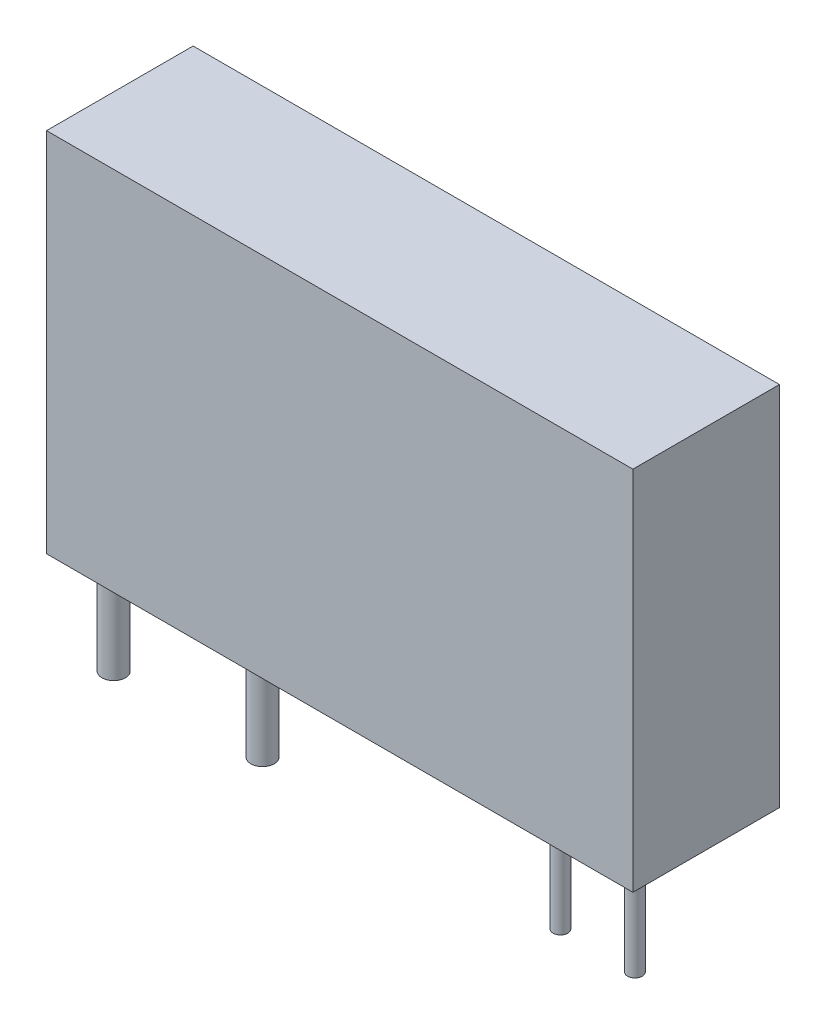
ISO-10303-21;
HEADER;
FILE_DESCRIPTION(('STEP AP214'),'2;1');
FILE_NAME('part.step','',(''),(''),'','','');
FILE_SCHEMA(('AUTOMOTIVE_DESIGN { 1 0 10303 214 1 1 1 1 }'));
ENDSEC;
DATA;
#1=APPLICATION_CONTEXT('core data for automotive mechanical design processes');
#2=APPLICATION_PROTOCOL_DEFINITION('international standard','automotive_design',2000,#1);
#3=PRODUCT_CONTEXT('',#1,'mechanical');
#4=PRODUCT('Part','Part','',(#3));
#5=PRODUCT_RELATED_PRODUCT_CATEGORY('part','',(#4));
#6=PRODUCT_DEFINITION_FORMATION('','',#4);
#7=PRODUCT_DEFINITION_CONTEXT('part definition',#1,'design');
#8=PRODUCT_DEFINITION('design','',#6,#7);
#9=PRODUCT_DEFINITION_SHAPE('','',#8);
#10=(LENGTH_UNIT() NAMED_UNIT(*) SI_UNIT(.MILLI.,.METRE.));
#11=(NAMED_UNIT(*) PLANE_ANGLE_UNIT() SI_UNIT($,.RADIAN.));
#12=(NAMED_UNIT(*) SI_UNIT($,.STERADIAN.) SOLID_ANGLE_UNIT());
#13=UNCERTAINTY_MEASURE_WITH_UNIT(LENGTH_MEASURE(1.E-05),#10,'distance_accuracy_value','');
#14=(GEOMETRIC_REPRESENTATION_CONTEXT(3) GLOBAL_UNCERTAINTY_ASSIGNED_CONTEXT((#13)) GLOBAL_UNIT_ASSIGNED_CONTEXT((#10,
#11,#12)) REPRESENTATION_CONTEXT('',''));
#15=CARTESIAN_POINT('',(0.,0.,0.));
#16=DIRECTION('',(0.,0.,1.));
#17=DIRECTION('',(1.,0.,0.));
#18=AXIS2_PLACEMENT_3D('',#15,#16,#17);
#19=CARTESIAN_POINT('',(-10.,12.5,2.50000000000001));
#20=DIRECTION('',(1.,0.,0.));
#21=DIRECTION('',(0.,0.,-1.));
#22=AXIS2_PLACEMENT_3D('',#19,#20,#21);
#23=PLANE('',#22);
#24=DIRECTION('',(0.,0.,1.));
#25=VECTOR('',#24,1.);
#26=CARTESIAN_POINT('',(-10.,0.,2.50000000000001));
#27=LINE('',#26,#25);
#28=CARTESIAN_POINT('',(-10.,0.,-2.5));
#29=VERTEX_POINT('',#28);
#30=CARTESIAN_POINT('',(-10.,0.,2.50000000000001));
#31=VERTEX_POINT('',#30);
#32=EDGE_CURVE('E102',#29,#31,#27,.T.);
#33=ORIENTED_EDGE('',*,*,#32,.T.);
#34=DIRECTION('',(0.,-1.,0.));
#35=VECTOR('',#34,1.);
#36=CARTESIAN_POINT('',(-10.,12.5,2.50000000000001));
#37=LINE('',#36,#35);
#38=CARTESIAN_POINT('',(-10.,12.5,2.50000000000001));
#39=VERTEX_POINT('',#38);
#40=EDGE_CURVE('E93',#39,#31,#37,.T.);
#41=ORIENTED_EDGE('',*,*,#40,.F.);
#42=DIRECTION('',(0.,0.,1.));
#43=VECTOR('',#42,1.);
#44=CARTESIAN_POINT('',(-10.,12.5,2.50000000000001));
#45=LINE('',#44,#43);
#46=CARTESIAN_POINT('',(-10.,12.5,-2.5));
#47=VERTEX_POINT('',#46);
#48=EDGE_CURVE('E87',#47,#39,#45,.T.);
#49=ORIENTED_EDGE('',*,*,#48,.F.);
#50=DIRECTION('',(0.,-1.,0.));
#51=VECTOR('',#50,1.);
#52=CARTESIAN_POINT('',(-10.,12.5,-2.5));
#53=LINE('',#52,#51);
#54=EDGE_CURVE('E98',#47,#29,#53,.T.);
#55=ORIENTED_EDGE('',*,*,#54,.T.);
#56=EDGE_LOOP('',(#33,#41,#49,#55));
#57=FACE_BOUND('',#56,.T.);
#58=ADVANCED_FACE('F35',(#57),#23,.F.);
#59=CARTESIAN_POINT('',(9.99999999999996,12.5,2.5));
#60=DIRECTION('',(0.,0.,-1.));
#61=DIRECTION('',(-1.,0.,0.));
#62=AXIS2_PLACEMENT_3D('',#59,#60,#61);
#63=PLANE('',#62);
#64=DIRECTION('',(1.,0.,0.));
#65=VECTOR('',#64,1.);
#66=CARTESIAN_POINT('',(9.99999999999996,0.,2.5));
#67=LINE('',#66,#65);
#68=CARTESIAN_POINT('',(9.99999999999996,0.,2.5));
#69=VERTEX_POINT('',#68);
#70=EDGE_CURVE('E92',#31,#69,#67,.T.);
#71=ORIENTED_EDGE('',*,*,#70,.T.);
#72=DIRECTION('',(0.,-1.,0.));
#73=VECTOR('',#72,1.);
#74=CARTESIAN_POINT('',(9.99999999999996,12.5,2.5));
#75=LINE('',#74,#73);
#76=CARTESIAN_POINT('',(9.99999999999996,12.5,2.5));
#77=VERTEX_POINT('',#76);
#78=EDGE_CURVE('E90',#77,#69,#75,.T.);
#79=ORIENTED_EDGE('',*,*,#78,.F.);
#80=DIRECTION('',(1.,0.,0.));
#81=VECTOR('',#80,1.);
#82=CARTESIAN_POINT('',(9.99999999999996,12.5,2.5));
#83=LINE('',#82,#81);
#84=EDGE_CURVE('E82',#39,#77,#83,.T.);
#85=ORIENTED_EDGE('',*,*,#84,.F.);
#86=ORIENTED_EDGE('',*,*,#40,.T.);
#87=EDGE_LOOP('',(#71,#79,#85,#86));
#88=FACE_BOUND('',#87,.T.);
#89=ADVANCED_FACE('F91',(#88),#63,.F.);
#90=CARTESIAN_POINT('',(9.99999999999996,12.5,2.5));
#91=DIRECTION('',(-1.,0.,0.));
#92=DIRECTION('',(0.,0.,1.));
#93=AXIS2_PLACEMENT_3D('',#90,#91,#92);
#94=PLANE('',#93);
#95=DIRECTION('',(0.,0.,-1.));
#96=VECTOR('',#95,1.);
#97=CARTESIAN_POINT('',(9.99999999999996,0.,2.5));
#98=LINE('',#97,#96);
#99=CARTESIAN_POINT('',(9.99999999999996,0.,-2.5));
#100=VERTEX_POINT('',#99);
#101=EDGE_CURVE('E68',#69,#100,#98,.T.);
#102=ORIENTED_EDGE('',*,*,#101,.T.);
#103=DIRECTION('',(0.,-1.,0.));
#104=VECTOR('',#103,1.);
#105=CARTESIAN_POINT('',(9.99999999999996,12.5,-2.5));
#106=LINE('',#105,#104);
#107=CARTESIAN_POINT('',(9.99999999999996,12.5,-2.5));
#108=VERTEX_POINT('',#107);
#109=EDGE_CURVE('E94',#108,#100,#106,.T.);
#110=ORIENTED_EDGE('',*,*,#109,.F.);
#111=DIRECTION('',(0.,0.,-1.));
#112=VECTOR('',#111,1.);
#113=CARTESIAN_POINT('',(9.99999999999996,12.5,2.5));
#114=LINE('',#113,#112);
#115=EDGE_CURVE('E85',#77,#108,#114,.T.);
#116=ORIENTED_EDGE('',*,*,#115,.F.);
#117=ORIENTED_EDGE('',*,*,#78,.T.);
#118=EDGE_LOOP('',(#102,#110,#116,#117));
#119=FACE_BOUND('',#118,.T.);
#120=ADVANCED_FACE('F96',(#119),#94,.F.);
#121=CARTESIAN_POINT('',(9.99999999999996,12.5,-2.5));
#122=DIRECTION('',(0.,0.,1.));
#123=DIRECTION('',(1.,0.,0.));
#124=AXIS2_PLACEMENT_3D('',#121,#122,#123);
#125=PLANE('',#124);
#126=DIRECTION('',(-1.,0.,0.));
#127=VECTOR('',#126,1.);
#128=CARTESIAN_POINT('',(9.99999999999996,0.,-2.5));
#129=LINE('',#128,#127);
#130=EDGE_CURVE('E74',#100,#29,#129,.T.);
#131=ORIENTED_EDGE('',*,*,#130,.T.);
#132=ORIENTED_EDGE('',*,*,#54,.F.);
#133=DIRECTION('',(-1.,0.,0.));
#134=VECTOR('',#133,1.);
#135=CARTESIAN_POINT('',(9.99999999999996,12.5,-2.5));
#136=LINE('',#135,#134);
#137=EDGE_CURVE('E51',#108,#47,#136,.T.);
#138=ORIENTED_EDGE('',*,*,#137,.F.);
#139=ORIENTED_EDGE('',*,*,#109,.T.);
#140=EDGE_LOOP('',(#131,#132,#138,#139));
#141=FACE_BOUND('',#140,.T.);
#142=ADVANCED_FACE('F134',(#141),#125,.F.);
#143=CARTESIAN_POINT('',(0.,12.5,0.));
#144=DIRECTION('',(0.,1.,0.));
#145=DIRECTION('',(0.,0.,1.));
#146=AXIS2_PLACEMENT_3D('',#143,#144,#145);
#147=PLANE('',#146);
#148=ORIENTED_EDGE('',*,*,#48,.T.);
#149=ORIENTED_EDGE('',*,*,#84,.T.);
#150=ORIENTED_EDGE('',*,*,#115,.T.);
#151=ORIENTED_EDGE('',*,*,#137,.T.);
#152=EDGE_LOOP('',(#148,#149,#150,#151));
#153=FACE_BOUND('',#152,.T.);
#154=ADVANCED_FACE('F83',(#153),#147,.T.);
#155=CARTESIAN_POINT('',(0.,0.,0.));
#156=DIRECTION('',(0.,1.,0.));
#157=DIRECTION('',(0.,0.,1.));
#158=AXIS2_PLACEMENT_3D('',#155,#156,#157);
#159=PLANE('',#158);
#160=CARTESIAN_POINT('',(8.89,0.,1.32));
#161=DIRECTION('',(0.,1.,0.));
#162=DIRECTION('',(0.,0.,1.));
#163=AXIS2_PLACEMENT_3D('',#160,#161,#162);
#164=CIRCLE('',#163,0.25);
#165=CARTESIAN_POINT('',(8.89,0.,1.57));
#166=VERTEX_POINT('',#165);
#167=EDGE_CURVE('E11',#166,#166,#164,.F.);
#168=ORIENTED_EDGE('',*,*,#167,.F.);
#169=EDGE_LOOP('',(#168));
#170=FACE_BOUND('',#169,.T.);
#171=CARTESIAN_POINT('',(6.35,0.,1.32));
#172=DIRECTION('',(0.,1.,0.));
#173=DIRECTION('',(0.,0.,1.));
#174=AXIS2_PLACEMENT_3D('',#171,#172,#173);
#175=CIRCLE('',#174,0.25);
#176=CARTESIAN_POINT('',(6.35,0.,1.57));
#177=VERTEX_POINT('',#176);
#178=EDGE_CURVE('E43',#177,#177,#175,.F.);
#179=ORIENTED_EDGE('',*,*,#178,.F.);
#180=EDGE_LOOP('',(#179));
#181=FACE_BOUND('',#180,.T.);
#182=CARTESIAN_POINT('',(-3.81,0.,1.32));
#183=DIRECTION('',(0.,1.,0.));
#184=DIRECTION('',(0.,0.,1.));
#185=AXIS2_PLACEMENT_3D('',#182,#183,#184);
#186=CIRCLE('',#185,0.4);
#187=CARTESIAN_POINT('',(-3.81,0.,1.72));
#188=VERTEX_POINT('',#187);
#189=EDGE_CURVE('E115',#188,#188,#186,.F.);
#190=ORIENTED_EDGE('',*,*,#189,.F.);
#191=EDGE_LOOP('',(#190));
#192=FACE_BOUND('',#191,.T.);
#193=CARTESIAN_POINT('',(-8.89,0.,1.32));
#194=DIRECTION('',(0.,1.,0.));
#195=DIRECTION('',(0.,0.,1.));
#196=AXIS2_PLACEMENT_3D('',#193,#194,#195);
#197=CIRCLE('',#196,0.4);
#198=CARTESIAN_POINT('',(-8.89,0.,1.72));
#199=VERTEX_POINT('',#198);
#200=EDGE_CURVE('E112',#199,#199,#197,.F.);
#201=ORIENTED_EDGE('',*,*,#200,.F.);
#202=EDGE_LOOP('',(#201));
#203=FACE_BOUND('',#202,.T.);
#204=ORIENTED_EDGE('',*,*,#32,.F.);
#205=ORIENTED_EDGE('',*,*,#130,.F.);
#206=ORIENTED_EDGE('',*,*,#101,.F.);
#207=ORIENTED_EDGE('',*,*,#70,.F.);
#208=EDGE_LOOP('',(#204,#205,#206,#207));
#209=FACE_BOUND('',#208,.T.);
#210=ADVANCED_FACE('F122',(#170,#181,#192,#203,#209),#159,.F.);
#211=CARTESIAN_POINT('',(-8.89,-3.5,1.32));
#212=DIRECTION('',(0.,1.,0.));
#213=DIRECTION('',(0.,0.,1.));
#214=AXIS2_PLACEMENT_3D('',#211,#212,#213);
#215=CYLINDRICAL_SURFACE('',#214,0.4);
#216=CARTESIAN_POINT('',(-8.89,-3.5,1.32));
#217=DIRECTION('',(0.,-1.,0.));
#218=DIRECTION('',(0.,0.,-1.));
#219=AXIS2_PLACEMENT_3D('',#216,#217,#218);
#220=CIRCLE('',#219,0.4);
#221=CARTESIAN_POINT('',(-8.89,-3.5,0.920000000000003));
#222=VERTEX_POINT('',#221);
#223=EDGE_CURVE('E105',#222,#222,#220,.T.);
#224=ORIENTED_EDGE('',*,*,#223,.F.);
#225=EDGE_LOOP('',(#224));
#226=FACE_BOUND('',#225,.T.);
#227=ORIENTED_EDGE('',*,*,#200,.T.);
#228=EDGE_LOOP('',(#227));
#229=FACE_BOUND('',#228,.T.);
#230=ADVANCED_FACE('F125',(#226,#229),#215,.T.);
#231=CARTESIAN_POINT('',(-8.89,-3.5,1.32));
#232=DIRECTION('',(0.,-1.,0.));
#233=DIRECTION('',(0.,0.,-1.));
#234=AXIS2_PLACEMENT_3D('',#231,#232,#233);
#235=PLANE('',#234);
#236=ORIENTED_EDGE('',*,*,#223,.T.);
#237=EDGE_LOOP('',(#236));
#238=FACE_BOUND('',#237,.T.);
#239=ADVANCED_FACE('F178',(#238),#235,.T.);
#240=CARTESIAN_POINT('',(-3.81,-3.5,1.32));
#241=DIRECTION('',(0.,1.,0.));
#242=DIRECTION('',(0.,0.,1.));
#243=AXIS2_PLACEMENT_3D('',#240,#241,#242);
#244=CYLINDRICAL_SURFACE('',#243,0.4);
#245=CARTESIAN_POINT('',(-3.81,-3.5,1.32));
#246=DIRECTION('',(0.,-1.,0.));
#247=DIRECTION('',(0.,0.,-1.));
#248=AXIS2_PLACEMENT_3D('',#245,#246,#247);
#249=CIRCLE('',#248,0.4);
#250=CARTESIAN_POINT('',(-3.81,-3.5,0.920000000000003));
#251=VERTEX_POINT('',#250);
#252=EDGE_CURVE('E257',#251,#251,#249,.T.);
#253=ORIENTED_EDGE('',*,*,#252,.F.);
#254=EDGE_LOOP('',(#253));
#255=FACE_BOUND('',#254,.T.);
#256=ORIENTED_EDGE('',*,*,#189,.T.);
#257=EDGE_LOOP('',(#256));
#258=FACE_BOUND('',#257,.T.);
#259=ADVANCED_FACE('F188',(#255,#258),#244,.T.);
#260=CARTESIAN_POINT('',(-3.81,-3.5,1.32));
#261=DIRECTION('',(0.,-1.,0.));
#262=DIRECTION('',(0.,0.,-1.));
#263=AXIS2_PLACEMENT_3D('',#260,#261,#262);
#264=PLANE('',#263);
#265=ORIENTED_EDGE('',*,*,#252,.T.);
#266=EDGE_LOOP('',(#265));
#267=FACE_BOUND('',#266,.T.);
#268=ADVANCED_FACE('F198',(#267),#264,.T.);
#269=CARTESIAN_POINT('',(6.35,-3.5,1.32));
#270=DIRECTION('',(0.,1.,0.));
#271=DIRECTION('',(0.,0.,1.));
#272=AXIS2_PLACEMENT_3D('',#269,#270,#271);
#273=CYLINDRICAL_SURFACE('',#272,0.25);
#274=CARTESIAN_POINT('',(6.35,-3.5,1.32));
#275=DIRECTION('',(0.,-1.,0.));
#276=DIRECTION('',(0.,0.,-1.));
#277=AXIS2_PLACEMENT_3D('',#274,#275,#276);
#278=CIRCLE('',#277,0.25);
#279=CARTESIAN_POINT('',(6.35,-3.5,1.07));
#280=VERTEX_POINT('',#279);
#281=EDGE_CURVE('E254',#280,#280,#278,.T.);
#282=ORIENTED_EDGE('',*,*,#281,.F.);
#283=EDGE_LOOP('',(#282));
#284=FACE_BOUND('',#283,.T.);
#285=ORIENTED_EDGE('',*,*,#178,.T.);
#286=EDGE_LOOP('',(#285));
#287=FACE_BOUND('',#286,.T.);
#288=ADVANCED_FACE('F120',(#284,#287),#273,.T.);
#289=CARTESIAN_POINT('',(6.35,-3.5,1.32));
#290=DIRECTION('',(0.,-1.,0.));
#291=DIRECTION('',(0.,0.,-1.));
#292=AXIS2_PLACEMENT_3D('',#289,#290,#291);
#293=PLANE('',#292);
#294=ORIENTED_EDGE('',*,*,#281,.T.);
#295=EDGE_LOOP('',(#294));
#296=FACE_BOUND('',#295,.T.);
#297=ADVANCED_FACE('F217',(#296),#293,.T.);
#298=CARTESIAN_POINT('',(8.89,-3.5,1.32));
#299=DIRECTION('',(0.,1.,0.));
#300=DIRECTION('',(0.,0.,1.));
#301=AXIS2_PLACEMENT_3D('',#298,#299,#300);
#302=CYLINDRICAL_SURFACE('',#301,0.25);
#303=CARTESIAN_POINT('',(8.89,-3.5,1.32));
#304=DIRECTION('',(0.,-1.,0.));
#305=DIRECTION('',(0.,0.,-1.));
#306=AXIS2_PLACEMENT_3D('',#303,#304,#305);
#307=CIRCLE('',#306,0.25);
#308=CARTESIAN_POINT('',(8.89,-3.5,1.07));
#309=VERTEX_POINT('',#308);
#310=EDGE_CURVE('E253',#309,#309,#307,.T.);
#311=ORIENTED_EDGE('',*,*,#310,.F.);
#312=EDGE_LOOP('',(#311));
#313=FACE_BOUND('',#312,.T.);
#314=ORIENTED_EDGE('',*,*,#167,.T.);
#315=EDGE_LOOP('',(#314));
#316=FACE_BOUND('',#315,.T.);
#317=ADVANCED_FACE('F227',(#313,#316),#302,.T.);
#318=CARTESIAN_POINT('',(8.89,-3.5,1.32));
#319=DIRECTION('',(0.,-1.,0.));
#320=DIRECTION('',(0.,0.,-1.));
#321=AXIS2_PLACEMENT_3D('',#318,#319,#320);
#322=PLANE('',#321);
#323=ORIENTED_EDGE('',*,*,#310,.T.);
#324=EDGE_LOOP('',(#323));
#325=FACE_BOUND('',#324,.T.);
#326=ADVANCED_FACE('F237',(#325),#322,.T.);
#327=CLOSED_SHELL('',(#58,#89,#120,#142,#154,#210,#230,#239,#259,#268,#288,#297,#317,#326));
#328=MANIFOLD_SOLID_BREP('B2',#327);
#329=ADVANCED_BREP_SHAPE_REPRESENTATION('',(#18,#328),#14);
#330=SHAPE_DEFINITION_REPRESENTATION(#9,#329);
ENDSEC;
END-ISO-10303-21;
